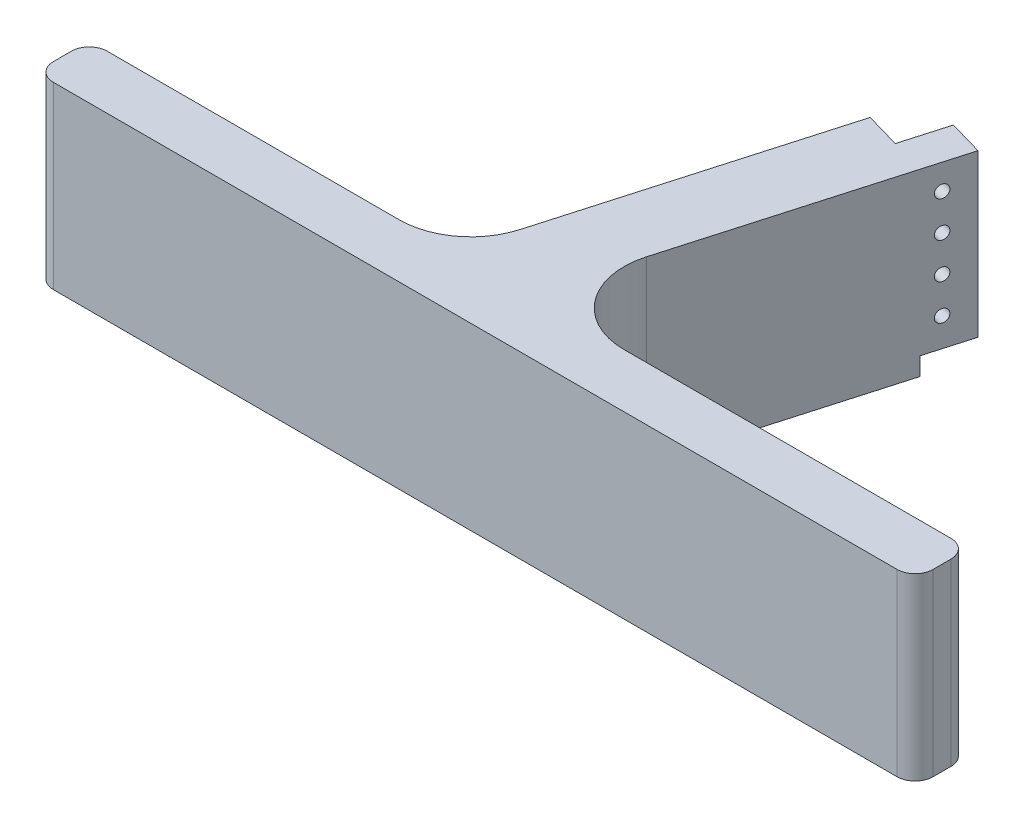
ISO-10303-21;
HEADER;
FILE_DESCRIPTION(('STEP AP214'),'2;1');
FILE_NAME('part.step','',(''),(''),'','','');
FILE_SCHEMA(('AUTOMOTIVE_DESIGN { 1 0 10303 214 1 1 1 1 }'));
ENDSEC;
DATA;
#1=APPLICATION_CONTEXT('core data for automotive mechanical design processes');
#2=APPLICATION_PROTOCOL_DEFINITION('international standard','automotive_design',2000,#1);
#3=PRODUCT_CONTEXT('',#1,'mechanical');
#4=PRODUCT('Part','Part','',(#3));
#5=PRODUCT_RELATED_PRODUCT_CATEGORY('part','',(#4));
#6=PRODUCT_DEFINITION_FORMATION('','',#4);
#7=PRODUCT_DEFINITION_CONTEXT('part definition',#1,'design');
#8=PRODUCT_DEFINITION('design','',#6,#7);
#9=PRODUCT_DEFINITION_SHAPE('','',#8);
#10=(LENGTH_UNIT() NAMED_UNIT(*) SI_UNIT(.MILLI.,.METRE.));
#11=(NAMED_UNIT(*) PLANE_ANGLE_UNIT() SI_UNIT($,.RADIAN.));
#12=(NAMED_UNIT(*) SI_UNIT($,.STERADIAN.) SOLID_ANGLE_UNIT());
#13=UNCERTAINTY_MEASURE_WITH_UNIT(LENGTH_MEASURE(1.E-05),#10,'distance_accuracy_value','');
#14=(GEOMETRIC_REPRESENTATION_CONTEXT(3) GLOBAL_UNCERTAINTY_ASSIGNED_CONTEXT((#13)) GLOBAL_UNIT_ASSIGNED_CONTEXT((#10,
#11,#12)) REPRESENTATION_CONTEXT('',''));
#15=CARTESIAN_POINT('',(0.,0.,0.));
#16=DIRECTION('',(0.,0.,1.));
#17=DIRECTION('',(1.,0.,0.));
#18=AXIS2_PLACEMENT_3D('',#15,#16,#17);
#19=CARTESIAN_POINT('',(18.1225693652221,28.0470131441213,118.980542411582));
#20=DIRECTION('',(-0.961315632512246,0.,-0.27544918712456));
#21=DIRECTION('',(-0.27544918712456,0.,0.961315632512246));
#22=AXIS2_PLACEMENT_3D('',#19,#20,#21);
#23=PLANE('',#22);
#24=DIRECTION('',(-0.27544918712456,0.,0.961315632512246));
#25=VECTOR('',#24,1.);
#26=CARTESIAN_POINT('',(18.1225693652221,-16.9529868558787,118.980542411582));
#27=LINE('',#26,#25);
#28=CARTESIAN_POINT('',(18.1225693652221,-16.9529868558787,118.980542411582));
#29=VERTEX_POINT('',#28);
#30=CARTESIAN_POINT('',(14.5211441526274,-16.9529868558787,131.549489854601));
#31=VERTEX_POINT('',#30);
#32=EDGE_CURVE('E157',#29,#31,#27,.T.);
#33=ORIENTED_EDGE('',*,*,#32,.T.);
#34=DIRECTION('',(0.,-1.,0.));
#35=VECTOR('',#34,1.);
#36=CARTESIAN_POINT('',(14.5211441526274,28.0470131441213,131.549489854601));
#37=LINE('',#36,#35);
#38=CARTESIAN_POINT('',(14.5211441526274,28.0470131441213,131.549489854601));
#39=VERTEX_POINT('',#38);
#40=EDGE_CURVE('E170',#39,#31,#37,.T.);
#41=ORIENTED_EDGE('',*,*,#40,.F.);
#42=DIRECTION('',(0.27544918712456,0.,-0.961315632512246));
#43=VECTOR('',#42,1.);
#44=CARTESIAN_POINT('',(18.1225693652221,28.0470131441213,118.980542411582));
#45=LINE('',#44,#43);
#46=CARTESIAN_POINT('',(18.1225693652221,28.0470131441213,118.980542411582));
#47=VERTEX_POINT('',#46);
#48=EDGE_CURVE('E277',#39,#47,#45,.T.);
#49=ORIENTED_EDGE('',*,*,#48,.T.);
#50=DIRECTION('',(0.,-1.,0.));
#51=VECTOR('',#50,1.);
#52=CARTESIAN_POINT('',(18.1225693652221,28.0470131441213,118.980542411582));
#53=LINE('',#52,#51);
#54=EDGE_CURVE('E172',#47,#29,#53,.T.);
#55=ORIENTED_EDGE('',*,*,#54,.T.);
#56=EDGE_LOOP('',(#33,#41,#49,#55));
#57=FACE_BOUND('',#56,.T.);
#58=CARTESIAN_POINT('',(15.8983900882501,-9.,126.74291169204));
#59=DIRECTION('',(-0.961315632512246,0.,-0.27544918712456));
#60=DIRECTION('',(-0.27544918712456,0.,0.961315632512246));
#61=AXIS2_PLACEMENT_3D('',#58,#59,#60);
#62=CIRCLE('',#61,1.75000000000001);
#63=CARTESIAN_POINT('',(15.4163540107822,-9.,128.425214048937));
#64=VERTEX_POINT('',#63);
#65=EDGE_CURVE('E301',#64,#64,#62,.F.);
#66=ORIENTED_EDGE('',*,*,#65,.T.);
#67=EDGE_LOOP('',(#66));
#68=FACE_BOUND('',#67,.T.);
#69=CARTESIAN_POINT('',(15.8983900882501,1.,126.74291169204));
#70=DIRECTION('',(-0.961315632512246,0.,-0.27544918712456));
#71=DIRECTION('',(-0.27544918712456,0.,0.961315632512246));
#72=AXIS2_PLACEMENT_3D('',#69,#70,#71);
#73=CIRCLE('',#72,1.75000000000001);
#74=CARTESIAN_POINT('',(15.4163540107822,1.,128.425214048937));
#75=VERTEX_POINT('',#74);
#76=EDGE_CURVE('E345',#75,#75,#73,.F.);
#77=ORIENTED_EDGE('',*,*,#76,.T.);
#78=EDGE_LOOP('',(#77));
#79=FACE_BOUND('',#78,.T.);
#80=CARTESIAN_POINT('',(15.8983900882501,11.,126.74291169204));
#81=DIRECTION('',(-0.961315632512246,0.,-0.27544918712456));
#82=DIRECTION('',(-0.27544918712456,0.,0.961315632512246));
#83=AXIS2_PLACEMENT_3D('',#80,#81,#82);
#84=CIRCLE('',#83,1.75000000000001);
#85=CARTESIAN_POINT('',(15.4163540107822,11.,128.425214048937));
#86=VERTEX_POINT('',#85);
#87=EDGE_CURVE('E351',#86,#86,#84,.F.);
#88=ORIENTED_EDGE('',*,*,#87,.T.);
#89=EDGE_LOOP('',(#88));
#90=FACE_BOUND('',#89,.T.);
#91=CARTESIAN_POINT('',(15.8983900882501,21.,126.74291169204));
#92=DIRECTION('',(-0.961315632512246,0.,-0.27544918712456));
#93=DIRECTION('',(-0.27544918712456,0.,0.961315632512246));
#94=AXIS2_PLACEMENT_3D('',#91,#92,#93);
#95=CIRCLE('',#94,1.75000000000001);
#96=CARTESIAN_POINT('',(15.4163540107822,21.,128.425214048937));
#97=VERTEX_POINT('',#96);
#98=EDGE_CURVE('E284',#97,#97,#95,.F.);
#99=ORIENTED_EDGE('',*,*,#98,.T.);
#100=EDGE_LOOP('',(#99));
#101=FACE_BOUND('',#100,.T.);
#102=ADVANCED_FACE('F35',(#57,#68,#79,#90,#101),#23,.T.);
#103=CARTESIAN_POINT('',(14.5211441526274,28.0470131441213,131.549489854601));
#104=DIRECTION('',(0.275449187124563,0.,-0.961315632512245));
#105=DIRECTION('',(-0.961315632512245,0.,-0.275449187124564));
#106=AXIS2_PLACEMENT_3D('',#103,#104,#105);
#107=PLANE('',#106);
#108=DIRECTION('',(0.961315632512245,0.,0.275449187124563));
#109=VECTOR('',#108,1.);
#110=CARTESIAN_POINT('',(14.5211441526274,-21.9529868558787,131.549489854601));
#111=LINE('',#110,#109);
#112=CARTESIAN_POINT('',(4.71572470100247,-21.9529868558787,128.739908145931));
#113=VERTEX_POINT('',#112);
#114=CARTESIAN_POINT('',(24.1343004777498,-21.9529868558787,134.303981725847));
#115=VERTEX_POINT('',#114);
#116=EDGE_CURVE('E50',#113,#115,#111,.T.);
#117=ORIENTED_EDGE('',*,*,#116,.F.);
#118=DIRECTION('',(0.,-1.,0.));
#119=VECTOR('',#118,1.);
#120=CARTESIAN_POINT('',(4.71572470100247,28.0470131441213,128.739908145931));
#121=LINE('',#120,#119);
#122=CARTESIAN_POINT('',(4.71572470100247,28.0470131441213,128.739908145931));
#123=VERTEX_POINT('',#122);
#124=EDGE_CURVE('E181',#123,#113,#121,.T.);
#125=ORIENTED_EDGE('',*,*,#124,.F.);
#126=DIRECTION('',(0.961315632512245,0.,0.275449187124563));
#127=VECTOR('',#126,1.);
#128=CARTESIAN_POINT('',(14.5211441526274,28.0470131441213,131.549489854601));
#129=LINE('',#128,#127);
#130=EDGE_CURVE('E179',#123,#39,#129,.T.);
#131=ORIENTED_EDGE('',*,*,#130,.T.);
#132=ORIENTED_EDGE('',*,*,#40,.T.);
#133=DIRECTION('',(0.961315632512246,0.,0.27544918712456));
#134=VECTOR('',#133,1.);
#135=CARTESIAN_POINT('',(1.06448656397641,-16.9529868558787,127.693705896818));
#136=LINE('',#135,#134);
#137=CARTESIAN_POINT('',(24.1343004777498,-16.9529868558787,134.303981725847));
#138=VERTEX_POINT('',#137);
#139=EDGE_CURVE('E154',#31,#138,#136,.T.);
#140=ORIENTED_EDGE('',*,*,#139,.T.);
#141=DIRECTION('',(0.,-1.,0.));
#142=VECTOR('',#141,1.);
#143=CARTESIAN_POINT('',(24.1343004777498,-16.9529868558787,134.303981725847));
#144=LINE('',#143,#142);
#145=EDGE_CURVE('E173',#138,#115,#144,.T.);
#146=ORIENTED_EDGE('',*,*,#145,.T.);
#147=EDGE_LOOP('',(#117,#125,#131,#132,#140,#146));
#148=FACE_BOUND('',#147,.T.);
#149=ADVANCED_FACE('F176',(#148),#107,.T.);
#150=CARTESIAN_POINT('',(4.71572470100247,28.0470131441213,128.739908145931));
#151=DIRECTION('',(-0.961315632512246,0.,-0.27544918712456));
#152=DIRECTION('',(-0.27544918712456,0.,0.961315632512246));
#153=AXIS2_PLACEMENT_3D('',#150,#151,#152);
#154=PLANE('',#153);
#155=DIRECTION('',(0.27544918712456,0.,-0.961315632512246));
#156=VECTOR('',#155,1.);
#157=CARTESIAN_POINT('',(4.71572470100247,-21.9529868558787,128.739908145931));
#158=LINE('',#157,#156);
#159=CARTESIAN_POINT('',(-16.9890827521031,-21.9529868558787,204.489526154073));
#160=VERTEX_POINT('',#159);
#161=EDGE_CURVE('E275',#160,#113,#158,.T.);
#162=ORIENTED_EDGE('',*,*,#161,.F.);
#163=DIRECTION('',(0.,-1.,0.));
#164=VECTOR('',#163,1.);
#165=CARTESIAN_POINT('',(-16.9890827521031,28.0470131441213,204.489526154073));
#166=LINE('',#165,#164);
#167=CARTESIAN_POINT('',(-16.9890827521031,28.0470131441213,204.489526154073));
#168=VERTEX_POINT('',#167);
#169=EDGE_CURVE('E184',#160,#168,#166,.F.);
#170=ORIENTED_EDGE('',*,*,#169,.T.);
#171=DIRECTION('',(0.27544918712456,0.,-0.961315632512246));
#172=VECTOR('',#171,1.);
#173=CARTESIAN_POINT('',(4.71572470100247,28.0470131441213,128.739908145931));
#174=LINE('',#173,#172);
#175=EDGE_CURVE('E297',#168,#123,#174,.T.);
#176=ORIENTED_EDGE('',*,*,#175,.T.);
#177=ORIENTED_EDGE('',*,*,#124,.T.);
#178=EDGE_LOOP('',(#162,#170,#176,#177));
#179=FACE_BOUND('',#178,.T.);
#180=ADVANCED_FACE('F336',(#179),#154,.T.);
#181=CARTESIAN_POINT('',(-21.1412451779947,28.0470131441213,218.980542411582));
#182=DIRECTION('',(0.,0.,-1.));
#183=DIRECTION('',(-1.,0.,0.));
#184=AXIS2_PLACEMENT_3D('',#181,#182,#183);
#185=PLANE('',#184);
#186=DIRECTION('',(1.,0.,0.));
#187=VECTOR('',#186,1.);
#188=CARTESIAN_POINT('',(-21.1412451779947,-21.9529868558787,218.980542411582));
#189=LINE('',#188,#187);
#190=CARTESIAN_POINT('',(-117.46074369328,-21.9529868558787,218.980542411582));
#191=VERTEX_POINT('',#190);
#192=CARTESIAN_POINT('',(-36.215395402348,-21.9529868558787,218.980542411582));
#193=VERTEX_POINT('',#192);
#194=EDGE_CURVE('E269',#191,#193,#189,.T.);
#195=ORIENTED_EDGE('',*,*,#194,.F.);
#196=DIRECTION('',(0.,-1.,0.));
#197=VECTOR('',#196,1.);
#198=CARTESIAN_POINT('',(-117.46074369328,28.0470131441213,218.980542411582));
#199=LINE('',#198,#197);
#200=CARTESIAN_POINT('',(-117.46074369328,28.0470131441213,218.980542411582));
#201=VERTEX_POINT('',#200);
#202=EDGE_CURVE('E11',#191,#201,#199,.F.);
#203=ORIENTED_EDGE('',*,*,#202,.T.);
#204=DIRECTION('',(1.,0.,0.));
#205=VECTOR('',#204,1.);
#206=CARTESIAN_POINT('',(-21.1412451779947,28.0470131441213,218.980542411582));
#207=LINE('',#206,#205);
#208=CARTESIAN_POINT('',(-36.215395402348,28.0470131441213,218.980542411582));
#209=VERTEX_POINT('',#208);
#210=EDGE_CURVE('E254',#201,#209,#207,.T.);
#211=ORIENTED_EDGE('',*,*,#210,.T.);
#212=DIRECTION('',(0.,-1.,0.));
#213=VECTOR('',#212,1.);
#214=CARTESIAN_POINT('',(-36.215395402348,-21.9529868558787,218.980542411582));
#215=LINE('',#214,#213);
#216=EDGE_CURVE('E180',#209,#193,#215,.T.);
#217=ORIENTED_EDGE('',*,*,#216,.T.);
#218=EDGE_LOOP('',(#195,#203,#211,#217));
#219=FACE_BOUND('',#218,.T.);
#220=ADVANCED_FACE('F333',(#219),#185,.T.);
#221=CARTESIAN_POINT('',(-122.46074369328,28.0470131441213,218.980542411582));
#222=DIRECTION('',(-1.,0.,0.));
#223=DIRECTION('',(0.,-1.,0.));
#224=AXIS2_PLACEMENT_3D('',#221,#222,#223);
#225=PLANE('',#224);
#226=DIRECTION('',(0.,0.,-1.));
#227=VECTOR('',#226,1.);
#228=CARTESIAN_POINT('',(-122.46074369328,-21.9529868558787,218.980542411582));
#229=LINE('',#228,#227);
#230=CARTESIAN_POINT('',(-122.46074369328,-21.9529868558787,228.980542411582));
#231=VERTEX_POINT('',#230);
#232=CARTESIAN_POINT('',(-122.46074369328,-21.9529868558787,223.980542411582));
#233=VERTEX_POINT('',#232);
#234=EDGE_CURVE('E248',#231,#233,#229,.T.);
#235=ORIENTED_EDGE('',*,*,#234,.F.);
#236=DIRECTION('',(0.,-1.,0.));
#237=VECTOR('',#236,1.);
#238=CARTESIAN_POINT('',(-122.46074369328,28.0470131441213,228.980542411582));
#239=LINE('',#238,#237);
#240=CARTESIAN_POINT('',(-122.46074369328,28.0470131441213,228.980542411582));
#241=VERTEX_POINT('',#240);
#242=EDGE_CURVE('E43',#231,#241,#239,.F.);
#243=ORIENTED_EDGE('',*,*,#242,.T.);
#244=DIRECTION('',(0.,0.,-1.));
#245=VECTOR('',#244,1.);
#246=CARTESIAN_POINT('',(-122.46074369328,28.0470131441213,218.980542411582));
#247=LINE('',#246,#245);
#248=CARTESIAN_POINT('',(-122.46074369328,28.0470131441213,223.980542411582));
#249=VERTEX_POINT('',#248);
#250=EDGE_CURVE('E245',#241,#249,#247,.T.);
#251=ORIENTED_EDGE('',*,*,#250,.T.);
#252=DIRECTION('',(0.,-1.,0.));
#253=VECTOR('',#252,1.);
#254=CARTESIAN_POINT('',(-122.46074369328,28.0470131441213,223.980542411582));
#255=LINE('',#254,#253);
#256=EDGE_CURVE('E238',#249,#233,#255,.T.);
#257=ORIENTED_EDGE('',*,*,#256,.T.);
#258=EDGE_LOOP('',(#235,#243,#251,#257));
#259=FACE_BOUND('',#258,.T.);
#260=ADVANCED_FACE('F244',(#259),#225,.T.);
#261=CARTESIAN_POINT('',(-122.46074369328,28.0470131441213,233.980542411582));
#262=DIRECTION('',(0.,0.,1.));
#263=DIRECTION('',(1.,0.,0.));
#264=AXIS2_PLACEMENT_3D('',#261,#262,#263);
#265=PLANE('',#264);
#266=DIRECTION('',(-1.,0.,0.));
#267=VECTOR('',#266,1.);
#268=CARTESIAN_POINT('',(-122.46074369328,-21.9529868558787,233.980542411582));
#269=LINE('',#268,#267);
#270=CARTESIAN_POINT('',(117.46074369328,-21.9529868558787,233.980542411582));
#271=VERTEX_POINT('',#270);
#272=CARTESIAN_POINT('',(-117.46074369328,-21.9529868558787,233.980542411582));
#273=VERTEX_POINT('',#272);
#274=EDGE_CURVE('E263',#271,#273,#269,.T.);
#275=ORIENTED_EDGE('',*,*,#274,.F.);
#276=DIRECTION('',(0.,-1.,0.));
#277=VECTOR('',#276,1.);
#278=CARTESIAN_POINT('',(117.46074369328,28.0470131441213,233.980542411582));
#279=LINE('',#278,#277);
#280=CARTESIAN_POINT('',(117.46074369328,28.0470131441213,233.980542411582));
#281=VERTEX_POINT('',#280);
#282=EDGE_CURVE('E236',#271,#281,#279,.F.);
#283=ORIENTED_EDGE('',*,*,#282,.T.);
#284=DIRECTION('',(-1.,0.,0.));
#285=VECTOR('',#284,1.);
#286=CARTESIAN_POINT('',(-122.46074369328,28.0470131441213,233.980542411582));
#287=LINE('',#286,#285);
#288=CARTESIAN_POINT('',(-117.46074369328,28.0470131441213,233.980542411582));
#289=VERTEX_POINT('',#288);
#290=EDGE_CURVE('E255',#281,#289,#287,.T.);
#291=ORIENTED_EDGE('',*,*,#290,.T.);
#292=DIRECTION('',(0.,-1.,0.));
#293=VECTOR('',#292,1.);
#294=CARTESIAN_POINT('',(-117.46074369328,28.0470131441213,233.980542411582));
#295=LINE('',#294,#293);
#296=EDGE_CURVE('E233',#289,#273,#295,.T.);
#297=ORIENTED_EDGE('',*,*,#296,.T.);
#298=EDGE_LOOP('',(#275,#283,#291,#297));
#299=FACE_BOUND('',#298,.T.);
#300=ADVANCED_FACE('F262',(#299),#265,.T.);
#301=CARTESIAN_POINT('',(122.46074369328,28.0470131441213,233.980542411582));
#302=DIRECTION('',(1.,0.,0.));
#303=DIRECTION('',(0.,0.,-1.));
#304=AXIS2_PLACEMENT_3D('',#301,#302,#303);
#305=PLANE('',#304);
#306=DIRECTION('',(0.,0.,1.));
#307=VECTOR('',#306,1.);
#308=CARTESIAN_POINT('',(122.46074369328,-21.9529868558787,233.980542411582));
#309=LINE('',#308,#307);
#310=CARTESIAN_POINT('',(122.46074369328,-21.9529868558787,223.980542411582));
#311=VERTEX_POINT('',#310);
#312=CARTESIAN_POINT('',(122.46074369328,-21.9529868558787,228.980542411582));
#313=VERTEX_POINT('',#312);
#314=EDGE_CURVE('E267',#311,#313,#309,.T.);
#315=ORIENTED_EDGE('',*,*,#314,.F.);
#316=DIRECTION('',(0.,-1.,0.));
#317=VECTOR('',#316,1.);
#318=CARTESIAN_POINT('',(122.46074369328,28.0470131441213,223.980542411582));
#319=LINE('',#318,#317);
#320=CARTESIAN_POINT('',(122.46074369328,28.0470131441213,223.980542411582));
#321=VERTEX_POINT('',#320);
#322=EDGE_CURVE('E224',#311,#321,#319,.F.);
#323=ORIENTED_EDGE('',*,*,#322,.T.);
#324=DIRECTION('',(0.,0.,1.));
#325=VECTOR('',#324,1.);
#326=CARTESIAN_POINT('',(122.46074369328,28.0470131441213,233.980542411582));
#327=LINE('',#326,#325);
#328=CARTESIAN_POINT('',(122.46074369328,28.0470131441213,228.980542411582));
#329=VERTEX_POINT('',#328);
#330=EDGE_CURVE('E292',#321,#329,#327,.T.);
#331=ORIENTED_EDGE('',*,*,#330,.T.);
#332=DIRECTION('',(0.,-1.,0.));
#333=VECTOR('',#332,1.);
#334=CARTESIAN_POINT('',(122.46074369328,28.0470131441213,228.980542411582));
#335=LINE('',#334,#333);
#336=EDGE_CURVE('E221',#329,#313,#335,.T.);
#337=ORIENTED_EDGE('',*,*,#336,.T.);
#338=EDGE_LOOP('',(#315,#323,#331,#337));
#339=FACE_BOUND('',#338,.T.);
#340=ADVANCED_FACE('F515',(#339),#305,.T.);
#341=CARTESIAN_POINT('',(122.46074369328,28.0470131441213,218.980542411582));
#342=DIRECTION('',(0.,0.,-1.));
#343=DIRECTION('',(-1.,0.,0.));
#344=AXIS2_PLACEMENT_3D('',#341,#342,#343);
#345=PLANE('',#344);
#346=DIRECTION('',(1.,0.,0.));
#347=VECTOR('',#346,1.);
#348=CARTESIAN_POINT('',(122.46074369328,28.0470131441213,218.980542411582));
#349=LINE('',#348,#347);
#350=CARTESIAN_POINT('',(26.4071168756193,28.0470131441213,218.980542411582));
#351=VERTEX_POINT('',#350);
#352=CARTESIAN_POINT('',(117.46074369328,28.0470131441213,218.980542411582));
#353=VERTEX_POINT('',#352);
#354=EDGE_CURVE('E289',#351,#353,#349,.T.);
#355=ORIENTED_EDGE('',*,*,#354,.T.);
#356=DIRECTION('',(0.,-1.,0.));
#357=VECTOR('',#356,1.);
#358=CARTESIAN_POINT('',(117.46074369328,28.0470131441213,218.980542411582));
#359=LINE('',#358,#357);
#360=CARTESIAN_POINT('',(117.46074369328,-21.9529868558787,218.980542411582));
#361=VERTEX_POINT('',#360);
#362=EDGE_CURVE('E210',#353,#361,#359,.T.);
#363=ORIENTED_EDGE('',*,*,#362,.T.);
#364=DIRECTION('',(1.,0.,0.));
#365=VECTOR('',#364,1.);
#366=CARTESIAN_POINT('',(122.46074369328,-21.9529868558787,218.980542411582));
#367=LINE('',#366,#365);
#368=CARTESIAN_POINT('',(26.4071168756193,-21.9529868558787,218.980542411582));
#369=VERTEX_POINT('',#368);
#370=EDGE_CURVE('E271',#369,#361,#367,.T.);
#371=ORIENTED_EDGE('',*,*,#370,.F.);
#372=DIRECTION('',(0.,-1.,0.));
#373=VECTOR('',#372,1.);
#374=CARTESIAN_POINT('',(26.4071168756192,28.0470131441213,218.980542411582));
#375=LINE('',#374,#373);
#376=EDGE_CURVE('E199',#369,#351,#375,.F.);
#377=ORIENTED_EDGE('',*,*,#376,.T.);
#378=EDGE_LOOP('',(#355,#363,#371,#377));
#379=FACE_BOUND('',#378,.T.);
#380=ADVANCED_FACE('F308',(#379),#345,.T.);
#381=CARTESIAN_POINT('',(-0.128375609640238,28.0470131441213,218.980542411582));
#382=DIRECTION('',(0.961315632512246,0.,0.27544918712456));
#383=DIRECTION('',(0.27544918712456,0.,-0.961315632512246));
#384=AXIS2_PLACEMENT_3D('',#381,#382,#383);
#385=PLANE('',#384);
#386=DIRECTION('',(-0.27544918712456,0.,0.961315632512246));
#387=VECTOR('',#386,1.);
#388=CARTESIAN_POINT('',(27.7357256903446,-16.9529868558787,121.735034282828));
#389=LINE('',#388,#387);
#390=CARTESIAN_POINT('',(27.7357256903446,-16.9529868558787,121.735034282828));
#391=VERTEX_POINT('',#390);
#392=EDGE_CURVE('E160',#391,#138,#389,.T.);
#393=ORIENTED_EDGE('',*,*,#392,.F.);
#394=DIRECTION('',(0.,-1.,0.));
#395=VECTOR('',#394,1.);
#396=CARTESIAN_POINT('',(27.7357256903445,28.0470131441213,121.735034282828));
#397=LINE('',#396,#395);
#398=CARTESIAN_POINT('',(27.7357256903445,28.0470131441213,121.735034282828));
#399=VERTEX_POINT('',#398);
#400=EDGE_CURVE('E187',#399,#391,#397,.T.);
#401=ORIENTED_EDGE('',*,*,#400,.F.);
#402=DIRECTION('',(-0.27544918712456,0.,0.961315632512246));
#403=VECTOR('',#402,1.);
#404=CARTESIAN_POINT('',(-0.128375609640238,28.0470131441213,218.980542411582));
#405=LINE('',#404,#403);
#406=CARTESIAN_POINT('',(7.18080422537435,28.0470131441213,193.471558669091));
#407=VERTEX_POINT('',#406);
#408=EDGE_CURVE('E281',#399,#407,#405,.T.);
#409=ORIENTED_EDGE('',*,*,#408,.T.);
#410=DIRECTION('',(0.,-1.,0.));
#411=VECTOR('',#410,1.);
#412=CARTESIAN_POINT('',(7.18080422537435,-21.9529868558787,193.471558669091));
#413=LINE('',#412,#411);
#414=CARTESIAN_POINT('',(7.18080422537435,-21.9529868558787,193.471558669091));
#415=VERTEX_POINT('',#414);
#416=EDGE_CURVE('E196',#407,#415,#413,.T.);
#417=ORIENTED_EDGE('',*,*,#416,.T.);
#418=DIRECTION('',(-0.27544918712456,0.,0.961315632512246));
#419=VECTOR('',#418,1.);
#420=CARTESIAN_POINT('',(-0.128375609640231,-21.9529868558787,218.980542411582));
#421=LINE('',#420,#419);
#422=EDGE_CURVE('E300',#115,#415,#421,.T.);
#423=ORIENTED_EDGE('',*,*,#422,.F.);
#424=ORIENTED_EDGE('',*,*,#145,.F.);
#425=EDGE_LOOP('',(#393,#401,#409,#417,#423,#424));
#426=FACE_BOUND('',#425,.T.);
#427=CARTESIAN_POINT('',(25.5115464133727,-9.,129.497403563286));
#428=DIRECTION('',(0.961315632512246,0.,0.27544918712456));
#429=DIRECTION('',(0.27544918712456,0.,-0.961315632512246));
#430=AXIS2_PLACEMENT_3D('',#427,#428,#429);
#431=CIRCLE('',#430,1.75000000000001);
#432=CARTESIAN_POINT('',(25.9935824908406,-9.,127.815101206389));
#433=VERTEX_POINT('',#432);
#434=EDGE_CURVE('E342',#433,#433,#431,.T.);
#435=ORIENTED_EDGE('',*,*,#434,.F.);
#436=EDGE_LOOP('',(#435));
#437=FACE_BOUND('',#436,.T.);
#438=CARTESIAN_POINT('',(25.5115464133727,1.,129.497403563286));
#439=DIRECTION('',(0.961315632512246,0.,0.27544918712456));
#440=DIRECTION('',(0.27544918712456,0.,-0.961315632512246));
#441=AXIS2_PLACEMENT_3D('',#438,#439,#440);
#442=CIRCLE('',#441,1.75000000000001);
#443=CARTESIAN_POINT('',(25.9935824908406,1.,127.815101206389));
#444=VERTEX_POINT('',#443);
#445=EDGE_CURVE('E348',#444,#444,#442,.T.);
#446=ORIENTED_EDGE('',*,*,#445,.F.);
#447=EDGE_LOOP('',(#446));
#448=FACE_BOUND('',#447,.T.);
#449=CARTESIAN_POINT('',(25.5115464133727,11.,129.497403563286));
#450=DIRECTION('',(0.961315632512246,0.,0.27544918712456));
#451=DIRECTION('',(0.27544918712456,0.,-0.961315632512246));
#452=AXIS2_PLACEMENT_3D('',#449,#450,#451);
#453=CIRCLE('',#452,1.75000000000001);
#454=CARTESIAN_POINT('',(25.9935824908406,11.,127.815101206389));
#455=VERTEX_POINT('',#454);
#456=EDGE_CURVE('E354',#455,#455,#453,.T.);
#457=ORIENTED_EDGE('',*,*,#456,.F.);
#458=EDGE_LOOP('',(#457));
#459=FACE_BOUND('',#458,.T.);
#460=CARTESIAN_POINT('',(25.5115464133727,21.,129.497403563286));
#461=DIRECTION('',(0.961315632512246,0.,0.27544918712456));
#462=DIRECTION('',(0.27544918712456,0.,-0.961315632512246));
#463=AXIS2_PLACEMENT_3D('',#460,#461,#462);
#464=CIRCLE('',#463,1.75000000000001);
#465=CARTESIAN_POINT('',(25.9935824908406,21.,127.815101206389));
#466=VERTEX_POINT('',#465);
#467=EDGE_CURVE('E341',#466,#466,#464,.T.);
#468=ORIENTED_EDGE('',*,*,#467,.F.);
#469=EDGE_LOOP('',(#468));
#470=FACE_BOUND('',#469,.T.);
#471=ADVANCED_FACE('F318',(#426,#437,#448,#459,#470),#385,.T.);
#472=CARTESIAN_POINT('',(27.7357256903445,28.0470131441213,121.735034282828));
#473=DIRECTION('',(0.275449187124561,0.,-0.961315632512245));
#474=DIRECTION('',(-0.961315632512245,0.,-0.275449187124561));
#475=AXIS2_PLACEMENT_3D('',#472,#473,#474);
#476=PLANE('',#475);
#477=DIRECTION('',(0.961315632512246,0.,0.27544918712456));
#478=VECTOR('',#477,1.);
#479=CARTESIAN_POINT('',(4.66591177657112,-16.9529868558787,115.124758453798));
#480=LINE('',#479,#478);
#481=EDGE_CURVE('E164',#29,#391,#480,.T.);
#482=ORIENTED_EDGE('',*,*,#481,.F.);
#483=ORIENTED_EDGE('',*,*,#54,.F.);
#484=DIRECTION('',(0.961315632512245,0.,0.275449187124561));
#485=VECTOR('',#484,1.);
#486=CARTESIAN_POINT('',(27.7357256903445,28.0470131441213,121.735034282828));
#487=LINE('',#486,#485);
#488=EDGE_CURVE('E278',#47,#399,#487,.T.);
#489=ORIENTED_EDGE('',*,*,#488,.T.);
#490=ORIENTED_EDGE('',*,*,#400,.T.);
#491=EDGE_LOOP('',(#482,#483,#489,#490));
#492=FACE_BOUND('',#491,.T.);
#493=ADVANCED_FACE('F322',(#492),#476,.T.);
#494=CARTESIAN_POINT('',(0.,28.0470131441213,0.));
#495=DIRECTION('',(0.,-1.,0.));
#496=DIRECTION('',(1.,0.,0.));
#497=AXIS2_PLACEMENT_3D('',#494,#495,#496);
#498=PLANE('',#497);
#499=ORIENTED_EDGE('',*,*,#330,.F.);
#500=CARTESIAN_POINT('',(117.46074369328,28.0470131441213,223.980542411582));
#501=DIRECTION('',(0.,-1.,0.));
#502=DIRECTION('',(1.,0.,0.));
#503=AXIS2_PLACEMENT_3D('',#500,#501,#502);
#504=CIRCLE('',#503,5.);
#505=EDGE_CURVE('E231',#321,#353,#504,.F.);
#506=ORIENTED_EDGE('',*,*,#505,.T.);
#507=ORIENTED_EDGE('',*,*,#354,.F.);
#508=CARTESIAN_POINT('',(26.4071168756193,28.0470131441213,198.980542411582));
#509=DIRECTION('',(0.,-1.,0.));
#510=DIRECTION('',(1.,0.,0.));
#511=AXIS2_PLACEMENT_3D('',#508,#509,#510);
#512=CIRCLE('',#511,20.);
#513=EDGE_CURVE('E208',#351,#407,#512,.T.);
#514=ORIENTED_EDGE('',*,*,#513,.T.);
#515=ORIENTED_EDGE('',*,*,#408,.F.);
#516=ORIENTED_EDGE('',*,*,#488,.F.);
#517=ORIENTED_EDGE('',*,*,#48,.F.);
#518=ORIENTED_EDGE('',*,*,#130,.F.);
#519=ORIENTED_EDGE('',*,*,#175,.F.);
#520=CARTESIAN_POINT('',(-36.215395402348,28.0470131441213,198.980542411582));
#521=DIRECTION('',(0.,-1.,0.));
#522=DIRECTION('',(1.,0.,0.));
#523=AXIS2_PLACEMENT_3D('',#520,#521,#522);
#524=CIRCLE('',#523,20.);
#525=EDGE_CURVE('E203',#168,#209,#524,.T.);
#526=ORIENTED_EDGE('',*,*,#525,.T.);
#527=ORIENTED_EDGE('',*,*,#210,.F.);
#528=CARTESIAN_POINT('',(-117.46074369328,28.0470131441212,223.980542411582));
#529=DIRECTION('',(0.,-1.,0.));
#530=DIRECTION('',(1.,0.,0.));
#531=AXIS2_PLACEMENT_3D('',#528,#529,#530);
#532=CIRCLE('',#531,5.);
#533=EDGE_CURVE('E226',#201,#249,#532,.F.);
#534=ORIENTED_EDGE('',*,*,#533,.T.);
#535=ORIENTED_EDGE('',*,*,#250,.F.);
#536=CARTESIAN_POINT('',(-117.46074369328,28.0470131441212,228.980542411582));
#537=DIRECTION('',(0.,-1.,0.));
#538=DIRECTION('',(1.,0.,0.));
#539=AXIS2_PLACEMENT_3D('',#536,#537,#538);
#540=CIRCLE('',#539,5.);
#541=EDGE_CURVE('E58',#241,#289,#540,.F.);
#542=ORIENTED_EDGE('',*,*,#541,.T.);
#543=ORIENTED_EDGE('',*,*,#290,.F.);
#544=CARTESIAN_POINT('',(117.46074369328,28.0470131441213,228.980542411582));
#545=DIRECTION('',(0.,-1.,0.));
#546=DIRECTION('',(1.,0.,0.));
#547=AXIS2_PLACEMENT_3D('',#544,#545,#546);
#548=CIRCLE('',#547,5.);
#549=EDGE_CURVE('E229',#281,#329,#548,.F.);
#550=ORIENTED_EDGE('',*,*,#549,.T.);
#551=EDGE_LOOP('',(#499,#506,#507,#514,#515,#516,#517,#518,#519,#526,#527,#534,#535,#542,#543,#550));
#552=FACE_BOUND('',#551,.T.);
#553=ADVANCED_FACE('F251',(#552),#498,.F.);
#554=CARTESIAN_POINT('',(0.,-21.9529868558787,0.));
#555=DIRECTION('',(0.,-1.,0.));
#556=DIRECTION('',(1.,0.,0.));
#557=AXIS2_PLACEMENT_3D('',#554,#555,#556);
#558=PLANE('',#557);
#559=ORIENTED_EDGE('',*,*,#116,.T.);
#560=ORIENTED_EDGE('',*,*,#422,.T.);
#561=CARTESIAN_POINT('',(26.4071168756193,-21.9529868558787,198.980542411582));
#562=DIRECTION('',(0.,-1.,0.));
#563=DIRECTION('',(1.,0.,0.));
#564=AXIS2_PLACEMENT_3D('',#561,#562,#563);
#565=CIRCLE('',#564,20.);
#566=EDGE_CURVE('E206',#415,#369,#565,.F.);
#567=ORIENTED_EDGE('',*,*,#566,.T.);
#568=ORIENTED_EDGE('',*,*,#370,.T.);
#569=CARTESIAN_POINT('',(117.46074369328,-21.9529868558787,223.980542411582));
#570=DIRECTION('',(0.,-1.,0.));
#571=DIRECTION('',(1.,0.,0.));
#572=AXIS2_PLACEMENT_3D('',#569,#570,#571);
#573=CIRCLE('',#572,5.);
#574=EDGE_CURVE('E219',#361,#311,#573,.T.);
#575=ORIENTED_EDGE('',*,*,#574,.T.);
#576=ORIENTED_EDGE('',*,*,#314,.T.);
#577=CARTESIAN_POINT('',(117.46074369328,-21.9529868558787,228.980542411582));
#578=DIRECTION('',(0.,-1.,0.));
#579=DIRECTION('',(1.,0.,0.));
#580=AXIS2_PLACEMENT_3D('',#577,#578,#579);
#581=CIRCLE('',#580,5.);
#582=EDGE_CURVE('E217',#313,#271,#581,.T.);
#583=ORIENTED_EDGE('',*,*,#582,.T.);
#584=ORIENTED_EDGE('',*,*,#274,.T.);
#585=CARTESIAN_POINT('',(-117.46074369328,-21.9529868558788,228.980542411582));
#586=DIRECTION('',(0.,-1.,0.));
#587=DIRECTION('',(1.,0.,0.));
#588=AXIS2_PLACEMENT_3D('',#585,#586,#587);
#589=CIRCLE('',#588,5.);
#590=EDGE_CURVE('E215',#273,#231,#589,.T.);
#591=ORIENTED_EDGE('',*,*,#590,.T.);
#592=ORIENTED_EDGE('',*,*,#234,.T.);
#593=CARTESIAN_POINT('',(-117.46074369328,-21.9529868558788,223.980542411582));
#594=DIRECTION('',(0.,-1.,0.));
#595=DIRECTION('',(1.,0.,0.));
#596=AXIS2_PLACEMENT_3D('',#593,#594,#595);
#597=CIRCLE('',#596,5.);
#598=EDGE_CURVE('E213',#233,#191,#597,.T.);
#599=ORIENTED_EDGE('',*,*,#598,.T.);
#600=ORIENTED_EDGE('',*,*,#194,.T.);
#601=CARTESIAN_POINT('',(-36.215395402348,-21.9529868558787,198.980542411582));
#602=DIRECTION('',(0.,-1.,0.));
#603=DIRECTION('',(1.,0.,0.));
#604=AXIS2_PLACEMENT_3D('',#601,#602,#603);
#605=CIRCLE('',#604,20.);
#606=EDGE_CURVE('E201',#193,#160,#605,.F.);
#607=ORIENTED_EDGE('',*,*,#606,.T.);
#608=ORIENTED_EDGE('',*,*,#161,.T.);
#609=EDGE_LOOP('',(#559,#560,#567,#568,#575,#576,#583,#584,#591,#592,#599,#600,#607,#608));
#610=FACE_BOUND('',#609,.T.);
#611=ADVANCED_FACE('F265',(#610),#558,.T.);
#612=CARTESIAN_POINT('',(-36.215395402348,28.0470131441213,198.980542411582));
#613=DIRECTION('',(0.,1.,0.));
#614=DIRECTION('',(-1.,0.,0.));
#615=AXIS2_PLACEMENT_3D('',#612,#613,#614);
#616=CYLINDRICAL_SURFACE('',#615,20.);
#617=ORIENTED_EDGE('',*,*,#525,.F.);
#618=ORIENTED_EDGE('',*,*,#169,.F.);
#619=ORIENTED_EDGE('',*,*,#606,.F.);
#620=ORIENTED_EDGE('',*,*,#216,.F.);
#621=EDGE_LOOP('',(#617,#618,#619,#620));
#622=FACE_BOUND('',#621,.T.);
#623=ADVANCED_FACE('F329',(#622),#616,.F.);
#624=CARTESIAN_POINT('',(26.4071168756193,28.0470131441213,198.980542411582));
#625=DIRECTION('',(0.,1.,0.));
#626=DIRECTION('',(-1.,0.,0.));
#627=AXIS2_PLACEMENT_3D('',#624,#625,#626);
#628=CYLINDRICAL_SURFACE('',#627,20.);
#629=ORIENTED_EDGE('',*,*,#513,.F.);
#630=ORIENTED_EDGE('',*,*,#376,.F.);
#631=ORIENTED_EDGE('',*,*,#566,.F.);
#632=ORIENTED_EDGE('',*,*,#416,.F.);
#633=EDGE_LOOP('',(#629,#630,#631,#632));
#634=FACE_BOUND('',#633,.T.);
#635=ADVANCED_FACE('F313',(#634),#628,.F.);
#636=CARTESIAN_POINT('',(117.46074369328,28.0470131441213,223.980542411582));
#637=DIRECTION('',(0.,-1.,0.));
#638=DIRECTION('',(1.,0.,0.));
#639=AXIS2_PLACEMENT_3D('',#636,#637,#638);
#640=CYLINDRICAL_SURFACE('',#639,5.);
#641=ORIENTED_EDGE('',*,*,#505,.F.);
#642=ORIENTED_EDGE('',*,*,#322,.F.);
#643=ORIENTED_EDGE('',*,*,#574,.F.);
#644=ORIENTED_EDGE('',*,*,#362,.F.);
#645=EDGE_LOOP('',(#641,#642,#643,#644));
#646=FACE_BOUND('',#645,.T.);
#647=ADVANCED_FACE('F390',(#646),#640,.T.);
#648=CARTESIAN_POINT('',(117.46074369328,28.0470131441213,228.980542411582));
#649=DIRECTION('',(0.,-1.,0.));
#650=DIRECTION('',(1.,0.,0.));
#651=AXIS2_PLACEMENT_3D('',#648,#649,#650);
#652=CYLINDRICAL_SURFACE('',#651,5.);
#653=ORIENTED_EDGE('',*,*,#549,.F.);
#654=ORIENTED_EDGE('',*,*,#282,.F.);
#655=ORIENTED_EDGE('',*,*,#582,.F.);
#656=ORIENTED_EDGE('',*,*,#336,.F.);
#657=EDGE_LOOP('',(#653,#654,#655,#656));
#658=FACE_BOUND('',#657,.T.);
#659=ADVANCED_FACE('F393',(#658),#652,.T.);
#660=CARTESIAN_POINT('',(-117.46074369328,28.0470131441213,228.980542411582));
#661=DIRECTION('',(0.,-1.,0.));
#662=DIRECTION('',(1.,0.,0.));
#663=AXIS2_PLACEMENT_3D('',#660,#661,#662);
#664=CYLINDRICAL_SURFACE('',#663,5.);
#665=ORIENTED_EDGE('',*,*,#541,.F.);
#666=ORIENTED_EDGE('',*,*,#242,.F.);
#667=ORIENTED_EDGE('',*,*,#590,.F.);
#668=ORIENTED_EDGE('',*,*,#296,.F.);
#669=EDGE_LOOP('',(#665,#666,#667,#668));
#670=FACE_BOUND('',#669,.T.);
#671=ADVANCED_FACE('F258',(#670),#664,.T.);
#672=CARTESIAN_POINT('',(-117.46074369328,28.0470131441213,223.980542411582));
#673=DIRECTION('',(0.,-1.,0.));
#674=DIRECTION('',(1.,0.,0.));
#675=AXIS2_PLACEMENT_3D('',#672,#673,#674);
#676=CYLINDRICAL_SURFACE('',#675,5.);
#677=ORIENTED_EDGE('',*,*,#533,.F.);
#678=ORIENTED_EDGE('',*,*,#202,.F.);
#679=ORIENTED_EDGE('',*,*,#598,.F.);
#680=ORIENTED_EDGE('',*,*,#256,.F.);
#681=EDGE_LOOP('',(#677,#678,#679,#680));
#682=FACE_BOUND('',#681,.T.);
#683=ADVANCED_FACE('F37',(#682),#676,.T.);
#684=CARTESIAN_POINT('',(11.1401204699798,21.,125.379507775424));
#685=DIRECTION('',(0.961315632512246,0.,0.27544918712456));
#686=DIRECTION('',(0.27544918712456,0.,-0.961315632512246));
#687=AXIS2_PLACEMENT_3D('',#684,#685,#686);
#688=CYLINDRICAL_SURFACE('',#687,1.75000000000001);
#689=ORIENTED_EDGE('',*,*,#467,.T.);
#690=EDGE_LOOP('',(#689));
#691=FACE_BOUND('',#690,.T.);
#692=ORIENTED_EDGE('',*,*,#98,.F.);
#693=EDGE_LOOP('',(#692));
#694=FACE_BOUND('',#693,.T.);
#695=ADVANCED_FACE('F365',(#691,#694),#688,.F.);
#696=CARTESIAN_POINT('',(11.1401204699798,11.,125.379507775424));
#697=DIRECTION('',(0.961315632512246,0.,0.27544918712456));
#698=DIRECTION('',(0.27544918712456,0.,-0.961315632512246));
#699=AXIS2_PLACEMENT_3D('',#696,#697,#698);
#700=CYLINDRICAL_SURFACE('',#699,1.75000000000001);
#701=ORIENTED_EDGE('',*,*,#456,.T.);
#702=EDGE_LOOP('',(#701));
#703=FACE_BOUND('',#702,.T.);
#704=ORIENTED_EDGE('',*,*,#87,.F.);
#705=EDGE_LOOP('',(#704));
#706=FACE_BOUND('',#705,.T.);
#707=ADVANCED_FACE('F367',(#703,#706),#700,.F.);
#708=CARTESIAN_POINT('',(11.1401204699798,1.,125.379507775424));
#709=DIRECTION('',(0.961315632512246,0.,0.27544918712456));
#710=DIRECTION('',(0.27544918712456,0.,-0.961315632512246));
#711=AXIS2_PLACEMENT_3D('',#708,#709,#710);
#712=CYLINDRICAL_SURFACE('',#711,1.75000000000001);
#713=ORIENTED_EDGE('',*,*,#445,.T.);
#714=EDGE_LOOP('',(#713));
#715=FACE_BOUND('',#714,.T.);
#716=ORIENTED_EDGE('',*,*,#76,.F.);
#717=EDGE_LOOP('',(#716));
#718=FACE_BOUND('',#717,.T.);
#719=ADVANCED_FACE('F373',(#715,#718),#712,.F.);
#720=CARTESIAN_POINT('',(11.1401204699798,-9.,125.379507775424));
#721=DIRECTION('',(0.961315632512246,0.,0.27544918712456));
#722=DIRECTION('',(0.27544918712456,0.,-0.961315632512246));
#723=AXIS2_PLACEMENT_3D('',#720,#721,#722);
#724=CYLINDRICAL_SURFACE('',#723,1.75000000000001);
#725=ORIENTED_EDGE('',*,*,#434,.T.);
#726=EDGE_LOOP('',(#725));
#727=FACE_BOUND('',#726,.T.);
#728=ORIENTED_EDGE('',*,*,#65,.F.);
#729=EDGE_LOOP('',(#728));
#730=FACE_BOUND('',#729,.T.);
#731=ADVANCED_FACE('F425',(#727,#730),#724,.F.);
#732=CARTESIAN_POINT('',(4.66591177657112,-16.9529868558787,115.124758453798));
#733=DIRECTION('',(0.,1.,0.));
#734=DIRECTION('',(0.,0.,1.));
#735=AXIS2_PLACEMENT_3D('',#732,#733,#734);
#736=PLANE('',#735);
#737=ORIENTED_EDGE('',*,*,#481,.T.);
#738=ORIENTED_EDGE('',*,*,#392,.T.);
#739=ORIENTED_EDGE('',*,*,#139,.F.);
#740=ORIENTED_EDGE('',*,*,#32,.F.);
#741=EDGE_LOOP('',(#737,#738,#739,#740));
#742=FACE_BOUND('',#741,.T.);
#743=ADVANCED_FACE('F156',(#742),#736,.F.);
#744=CLOSED_SHELL('',(#102,#149,#180,#220,#260,#300,#340,#380,#471,#493,#553,#611,#623,#635,
#647,#659,#671,#683,#695,#707,#719,#731,#743));
#745=MANIFOLD_SOLID_BREP('B2',#744);
#746=ADVANCED_BREP_SHAPE_REPRESENTATION('',(#18,#745),#14);
#747=SHAPE_DEFINITION_REPRESENTATION(#9,#746);
ENDSEC;
END-ISO-10303-21;
